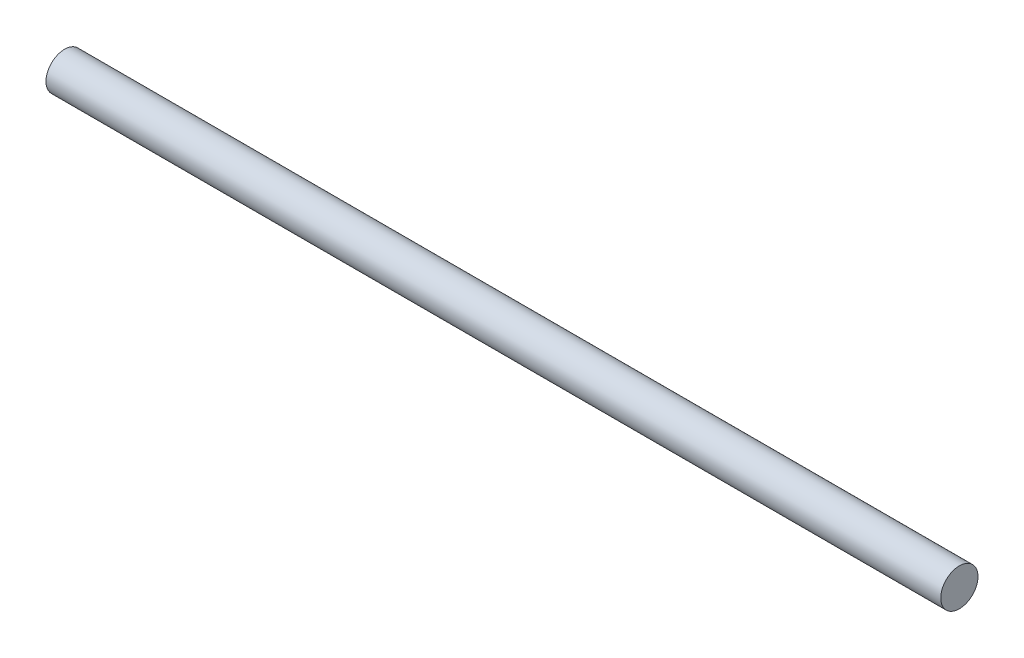
ISO-10303-21;
HEADER;
FILE_DESCRIPTION(('STEP AP214'),'2;1');
FILE_NAME('part.step','',(''),(''),'','','');
FILE_SCHEMA(('AUTOMOTIVE_DESIGN { 1 0 10303 214 1 1 1 1 }'));
ENDSEC;
DATA;
#1=APPLICATION_CONTEXT('core data for automotive mechanical design processes');
#2=APPLICATION_PROTOCOL_DEFINITION('international standard','automotive_design',2000,#1);
#3=PRODUCT_CONTEXT('',#1,'mechanical');
#4=PRODUCT('Part','Part','',(#3));
#5=PRODUCT_RELATED_PRODUCT_CATEGORY('part','',(#4));
#6=PRODUCT_DEFINITION_FORMATION('','',#4);
#7=PRODUCT_DEFINITION_CONTEXT('part definition',#1,'design');
#8=PRODUCT_DEFINITION('design','',#6,#7);
#9=PRODUCT_DEFINITION_SHAPE('','',#8);
#10=(LENGTH_UNIT() NAMED_UNIT(*) SI_UNIT(.MILLI.,.METRE.));
#11=(NAMED_UNIT(*) PLANE_ANGLE_UNIT() SI_UNIT($,.RADIAN.));
#12=(NAMED_UNIT(*) SI_UNIT($,.STERADIAN.) SOLID_ANGLE_UNIT());
#13=UNCERTAINTY_MEASURE_WITH_UNIT(LENGTH_MEASURE(1.E-05),#10,'distance_accuracy_value','');
#14=(GEOMETRIC_REPRESENTATION_CONTEXT(3) GLOBAL_UNCERTAINTY_ASSIGNED_CONTEXT((#13)) GLOBAL_UNIT_ASSIGNED_CONTEXT((#10,
#11,#12)) REPRESENTATION_CONTEXT('',''));
#15=CARTESIAN_POINT('',(0.,0.,0.));
#16=DIRECTION('',(0.,0.,1.));
#17=DIRECTION('',(1.,0.,0.));
#18=AXIS2_PLACEMENT_3D('',#15,#16,#17);
#19=CARTESIAN_POINT('',(228.6,0.,0.));
#20=DIRECTION('',(-1.,0.,0.));
#21=DIRECTION('',(0.,0.,1.));
#22=AXIS2_PLACEMENT_3D('',#19,#20,#21);
#23=CYLINDRICAL_SURFACE('',#22,4.7625);
#24=CARTESIAN_POINT('',(228.6,0.,0.));
#25=DIRECTION('',(1.,0.,0.));
#26=DIRECTION('',(0.,0.,-1.));
#27=AXIS2_PLACEMENT_3D('',#24,#25,#26);
#28=CIRCLE('',#27,4.7625);
#29=CARTESIAN_POINT('',(228.6,0.,-4.7625));
#30=VERTEX_POINT('',#29);
#31=EDGE_CURVE('E10',#30,#30,#28,.T.);
#32=ORIENTED_EDGE('',*,*,#31,.F.);
#33=EDGE_LOOP('',(#32));
#34=FACE_BOUND('',#33,.T.);
#35=CARTESIAN_POINT('',(0.,0.,0.));
#36=DIRECTION('',(1.,0.,0.));
#37=DIRECTION('',(0.,0.,-1.));
#38=AXIS2_PLACEMENT_3D('',#35,#36,#37);
#39=CIRCLE('',#38,4.7625);
#40=CARTESIAN_POINT('',(0.,0.,-4.7625));
#41=VERTEX_POINT('',#40);
#42=EDGE_CURVE('E33',#41,#41,#39,.T.);
#43=ORIENTED_EDGE('',*,*,#42,.T.);
#44=EDGE_LOOP('',(#43));
#45=FACE_BOUND('',#44,.T.);
#46=ADVANCED_FACE('F30',(#34,#45),#23,.T.);
#47=CARTESIAN_POINT('',(228.6,0.,0.));
#48=DIRECTION('',(1.,0.,0.));
#49=DIRECTION('',(0.,0.,-1.));
#50=AXIS2_PLACEMENT_3D('',#47,#48,#49);
#51=PLANE('',#50);
#52=ORIENTED_EDGE('',*,*,#31,.T.);
#53=EDGE_LOOP('',(#52));
#54=FACE_BOUND('',#53,.T.);
#55=ADVANCED_FACE('F45',(#54),#51,.T.);
#56=CARTESIAN_POINT('',(0.,0.,0.));
#57=DIRECTION('',(1.,0.,0.));
#58=DIRECTION('',(0.,0.,-1.));
#59=AXIS2_PLACEMENT_3D('',#56,#57,#58);
#60=PLANE('',#59);
#61=ORIENTED_EDGE('',*,*,#42,.F.);
#62=EDGE_LOOP('',(#61));
#63=FACE_BOUND('',#62,.T.);
#64=ADVANCED_FACE('F43',(#63),#60,.F.);
#65=CLOSED_SHELL('',(#46,#55,#64));
#66=MANIFOLD_SOLID_BREP('B2',#65);
#67=ADVANCED_BREP_SHAPE_REPRESENTATION('',(#18,#66),#14);
#68=SHAPE_DEFINITION_REPRESENTATION(#9,#67);
ENDSEC;
END-ISO-10303-21;
